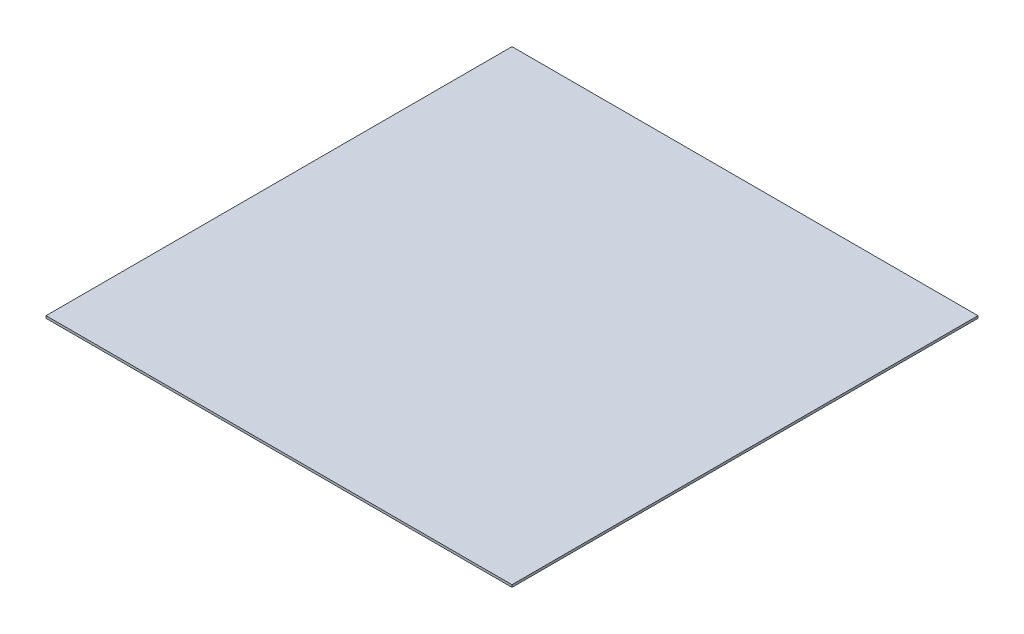
ISO-10303-21;
HEADER;
FILE_DESCRIPTION(('STEP AP214'),'2;1');
FILE_NAME('part.step','',(''),(''),'','','');
FILE_SCHEMA(('AUTOMOTIVE_DESIGN { 1 0 10303 214 1 1 1 1 }'));
ENDSEC;
DATA;
#1=APPLICATION_CONTEXT('core data for automotive mechanical design processes');
#2=APPLICATION_PROTOCOL_DEFINITION('international standard','automotive_design',2000,#1);
#3=PRODUCT_CONTEXT('',#1,'mechanical');
#4=PRODUCT('Part','Part','',(#3));
#5=PRODUCT_RELATED_PRODUCT_CATEGORY('part','',(#4));
#6=PRODUCT_DEFINITION_FORMATION('','',#4);
#7=PRODUCT_DEFINITION_CONTEXT('part definition',#1,'design');
#8=PRODUCT_DEFINITION('design','',#6,#7);
#9=PRODUCT_DEFINITION_SHAPE('','',#8);
#10=(LENGTH_UNIT() NAMED_UNIT(*) SI_UNIT(.MILLI.,.METRE.));
#11=(NAMED_UNIT(*) PLANE_ANGLE_UNIT() SI_UNIT($,.RADIAN.));
#12=(NAMED_UNIT(*) SI_UNIT($,.STERADIAN.) SOLID_ANGLE_UNIT());
#13=UNCERTAINTY_MEASURE_WITH_UNIT(LENGTH_MEASURE(1.E-05),#10,'distance_accuracy_value','');
#14=(GEOMETRIC_REPRESENTATION_CONTEXT(3) GLOBAL_UNCERTAINTY_ASSIGNED_CONTEXT((#13)) GLOBAL_UNIT_ASSIGNED_CONTEXT((#10,
#11,#12)) REPRESENTATION_CONTEXT('',''));
#15=CARTESIAN_POINT('',(0.,0.,0.));
#16=DIRECTION('',(0.,0.,1.));
#17=DIRECTION('',(1.,0.,0.));
#18=AXIS2_PLACEMENT_3D('',#15,#16,#17);
#19=CARTESIAN_POINT('',(-50.,0.5,-50.));
#20=DIRECTION('',(1.,0.,0.));
#21=DIRECTION('',(0.,0.,-1.));
#22=AXIS2_PLACEMENT_3D('',#19,#20,#21);
#23=PLANE('',#22);
#24=DIRECTION('',(0.,0.,1.));
#25=VECTOR('',#24,1.);
#26=CARTESIAN_POINT('',(-50.,0.,-50.));
#27=LINE('',#26,#25);
#28=CARTESIAN_POINT('',(-50.,0.,-50.));
#29=VERTEX_POINT('',#28);
#30=CARTESIAN_POINT('',(-50.,0.,50.));
#31=VERTEX_POINT('',#30);
#32=EDGE_CURVE('E107',#29,#31,#27,.T.);
#33=ORIENTED_EDGE('',*,*,#32,.T.);
#34=DIRECTION('',(0.,-1.,0.));
#35=VECTOR('',#34,1.);
#36=CARTESIAN_POINT('',(-50.,0.5,50.));
#37=LINE('',#36,#35);
#38=CARTESIAN_POINT('',(-50.,0.5,50.));
#39=VERTEX_POINT('',#38);
#40=EDGE_CURVE('E11',#39,#31,#37,.T.);
#41=ORIENTED_EDGE('',*,*,#40,.F.);
#42=DIRECTION('',(0.,0.,1.));
#43=VECTOR('',#42,1.);
#44=CARTESIAN_POINT('',(-50.,0.5,-50.));
#45=LINE('',#44,#43);
#46=CARTESIAN_POINT('',(-50.,0.5,-50.));
#47=VERTEX_POINT('',#46);
#48=EDGE_CURVE('E91',#47,#39,#45,.T.);
#49=ORIENTED_EDGE('',*,*,#48,.F.);
#50=DIRECTION('',(0.,-1.,0.));
#51=VECTOR('',#50,1.);
#52=CARTESIAN_POINT('',(-50.,0.5,-50.));
#53=LINE('',#52,#51);
#54=EDGE_CURVE('E103',#47,#29,#53,.T.);
#55=ORIENTED_EDGE('',*,*,#54,.T.);
#56=EDGE_LOOP('',(#33,#41,#49,#55));
#57=FACE_BOUND('',#56,.T.);
#58=ADVANCED_FACE('F39',(#57),#23,.F.);
#59=CARTESIAN_POINT('',(50.,0.5,50.));
#60=DIRECTION('',(0.,0.,-1.));
#61=DIRECTION('',(-1.,0.,0.));
#62=AXIS2_PLACEMENT_3D('',#59,#60,#61);
#63=PLANE('',#62);
#64=DIRECTION('',(1.,0.,0.));
#65=VECTOR('',#64,1.);
#66=CARTESIAN_POINT('',(50.,0.,50.));
#67=LINE('',#66,#65);
#68=CARTESIAN_POINT('',(50.,0.,50.));
#69=VERTEX_POINT('',#68);
#70=EDGE_CURVE('E96',#31,#69,#67,.T.);
#71=ORIENTED_EDGE('',*,*,#70,.T.);
#72=DIRECTION('',(0.,-1.,0.));
#73=VECTOR('',#72,1.);
#74=CARTESIAN_POINT('',(50.,0.5,50.));
#75=LINE('',#74,#73);
#76=CARTESIAN_POINT('',(50.,0.5,50.));
#77=VERTEX_POINT('',#76);
#78=EDGE_CURVE('E48',#77,#69,#75,.T.);
#79=ORIENTED_EDGE('',*,*,#78,.F.);
#80=DIRECTION('',(1.,0.,0.));
#81=VECTOR('',#80,1.);
#82=CARTESIAN_POINT('',(50.,0.5,50.));
#83=LINE('',#82,#81);
#84=EDGE_CURVE('E86',#39,#77,#83,.T.);
#85=ORIENTED_EDGE('',*,*,#84,.F.);
#86=ORIENTED_EDGE('',*,*,#40,.T.);
#87=EDGE_LOOP('',(#71,#79,#85,#86));
#88=FACE_BOUND('',#87,.T.);
#89=ADVANCED_FACE('F95',(#88),#63,.F.);
#90=CARTESIAN_POINT('',(50.,0.5,-50.));
#91=DIRECTION('',(-1.,0.,0.));
#92=DIRECTION('',(0.,0.,1.));
#93=AXIS2_PLACEMENT_3D('',#90,#91,#92);
#94=PLANE('',#93);
#95=DIRECTION('',(0.,0.,-1.));
#96=VECTOR('',#95,1.);
#97=CARTESIAN_POINT('',(50.,0.,-50.));
#98=LINE('',#97,#96);
#99=CARTESIAN_POINT('',(50.,0.,-50.));
#100=VERTEX_POINT('',#99);
#101=EDGE_CURVE('E73',#69,#100,#98,.T.);
#102=ORIENTED_EDGE('',*,*,#101,.T.);
#103=DIRECTION('',(0.,-1.,0.));
#104=VECTOR('',#103,1.);
#105=CARTESIAN_POINT('',(50.,0.5,-50.));
#106=LINE('',#105,#104);
#107=CARTESIAN_POINT('',(50.,0.5,-50.));
#108=VERTEX_POINT('',#107);
#109=EDGE_CURVE('E98',#108,#100,#106,.T.);
#110=ORIENTED_EDGE('',*,*,#109,.F.);
#111=DIRECTION('',(0.,0.,-1.));
#112=VECTOR('',#111,1.);
#113=CARTESIAN_POINT('',(50.,0.5,-50.));
#114=LINE('',#113,#112);
#115=EDGE_CURVE('E89',#77,#108,#114,.T.);
#116=ORIENTED_EDGE('',*,*,#115,.F.);
#117=ORIENTED_EDGE('',*,*,#78,.T.);
#118=EDGE_LOOP('',(#102,#110,#116,#117));
#119=FACE_BOUND('',#118,.T.);
#120=ADVANCED_FACE('F99',(#119),#94,.F.);
#121=CARTESIAN_POINT('',(50.,0.5,-50.));
#122=DIRECTION('',(0.,0.,1.));
#123=DIRECTION('',(1.,0.,0.));
#124=AXIS2_PLACEMENT_3D('',#121,#122,#123);
#125=PLANE('',#124);
#126=DIRECTION('',(-1.,0.,0.));
#127=VECTOR('',#126,1.);
#128=CARTESIAN_POINT('',(50.,0.,-50.));
#129=LINE('',#128,#127);
#130=EDGE_CURVE('E79',#100,#29,#129,.T.);
#131=ORIENTED_EDGE('',*,*,#130,.T.);
#132=ORIENTED_EDGE('',*,*,#54,.F.);
#133=DIRECTION('',(-1.,0.,0.));
#134=VECTOR('',#133,1.);
#135=CARTESIAN_POINT('',(50.,0.5,-50.));
#136=LINE('',#135,#134);
#137=EDGE_CURVE('E56',#108,#47,#136,.T.);
#138=ORIENTED_EDGE('',*,*,#137,.F.);
#139=ORIENTED_EDGE('',*,*,#109,.T.);
#140=EDGE_LOOP('',(#131,#132,#138,#139));
#141=FACE_BOUND('',#140,.T.);
#142=ADVANCED_FACE('F120',(#141),#125,.F.);
#143=CARTESIAN_POINT('',(0.,0.5,0.));
#144=DIRECTION('',(0.,-1.,0.));
#145=DIRECTION('',(0.,0.,-1.));
#146=AXIS2_PLACEMENT_3D('',#143,#144,#145);
#147=PLANE('',#146);
#148=ORIENTED_EDGE('',*,*,#48,.T.);
#149=ORIENTED_EDGE('',*,*,#84,.T.);
#150=ORIENTED_EDGE('',*,*,#115,.T.);
#151=ORIENTED_EDGE('',*,*,#137,.T.);
#152=EDGE_LOOP('',(#148,#149,#150,#151));
#153=FACE_BOUND('',#152,.T.);
#154=ADVANCED_FACE('F87',(#153),#147,.F.);
#155=CARTESIAN_POINT('',(0.,0.,0.));
#156=DIRECTION('',(0.,-1.,0.));
#157=DIRECTION('',(0.,0.,-1.));
#158=AXIS2_PLACEMENT_3D('',#155,#156,#157);
#159=PLANE('',#158);
#160=ORIENTED_EDGE('',*,*,#32,.F.);
#161=ORIENTED_EDGE('',*,*,#130,.F.);
#162=ORIENTED_EDGE('',*,*,#101,.F.);
#163=ORIENTED_EDGE('',*,*,#70,.F.);
#164=EDGE_LOOP('',(#160,#161,#162,#163));
#165=FACE_BOUND('',#164,.T.);
#166=ADVANCED_FACE('F123',(#165),#159,.T.);
#167=CLOSED_SHELL('',(#58,#89,#120,#142,#154,#166));
#168=MANIFOLD_SOLID_BREP('B2',#167);
#169=ADVANCED_BREP_SHAPE_REPRESENTATION('',(#18,#168),#14);
#170=SHAPE_DEFINITION_REPRESENTATION(#9,#169);
ENDSEC;
END-ISO-10303-21;
